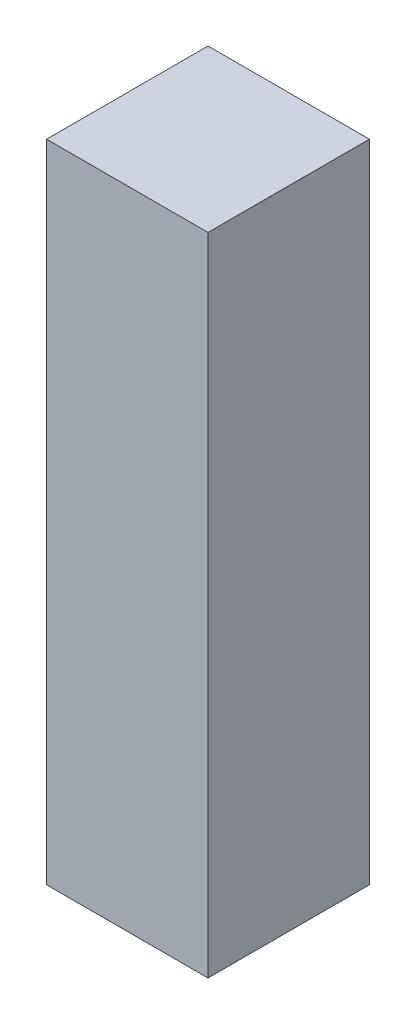
ISO-10303-21;
HEADER;
FILE_DESCRIPTION(('STEP AP214'),'2;1');
FILE_NAME('part.step','',(''),(''),'','','');
FILE_SCHEMA(('AUTOMOTIVE_DESIGN { 1 0 10303 214 1 1 1 1 }'));
ENDSEC;
DATA;
#1=APPLICATION_CONTEXT('core data for automotive mechanical design processes');
#2=APPLICATION_PROTOCOL_DEFINITION('international standard','automotive_design',2000,#1);
#3=PRODUCT_CONTEXT('',#1,'mechanical');
#4=PRODUCT('Part','Part','',(#3));
#5=PRODUCT_RELATED_PRODUCT_CATEGORY('part','',(#4));
#6=PRODUCT_DEFINITION_FORMATION('','',#4);
#7=PRODUCT_DEFINITION_CONTEXT('part definition',#1,'design');
#8=PRODUCT_DEFINITION('design','',#6,#7);
#9=PRODUCT_DEFINITION_SHAPE('','',#8);
#10=(LENGTH_UNIT() NAMED_UNIT(*) SI_UNIT(.MILLI.,.METRE.));
#11=(NAMED_UNIT(*) PLANE_ANGLE_UNIT() SI_UNIT($,.RADIAN.));
#12=(NAMED_UNIT(*) SI_UNIT($,.STERADIAN.) SOLID_ANGLE_UNIT());
#13=UNCERTAINTY_MEASURE_WITH_UNIT(LENGTH_MEASURE(1.E-05),#10,'distance_accuracy_value','');
#14=(GEOMETRIC_REPRESENTATION_CONTEXT(3) GLOBAL_UNCERTAINTY_ASSIGNED_CONTEXT((#13)) GLOBAL_UNIT_ASSIGNED_CONTEXT((#10,
#11,#12)) REPRESENTATION_CONTEXT('',''));
#15=CARTESIAN_POINT('',(0.,0.,0.));
#16=DIRECTION('',(0.,0.,1.));
#17=DIRECTION('',(1.,0.,0.));
#18=AXIS2_PLACEMENT_3D('',#15,#16,#17);
#19=CARTESIAN_POINT('',(9.525,76.2,9.525));
#20=DIRECTION('',(-1.,0.,0.));
#21=DIRECTION('',(0.,0.,1.));
#22=AXIS2_PLACEMENT_3D('',#19,#20,#21);
#23=PLANE('',#22);
#24=DIRECTION('',(0.,0.,-1.));
#25=VECTOR('',#24,1.);
#26=CARTESIAN_POINT('',(9.525,0.,9.525));
#27=LINE('',#26,#25);
#28=CARTESIAN_POINT('',(9.525,0.,9.525));
#29=VERTEX_POINT('',#28);
#30=CARTESIAN_POINT('',(9.525,0.,-9.525));
#31=VERTEX_POINT('',#30);
#32=EDGE_CURVE('E102',#29,#31,#27,.T.);
#33=ORIENTED_EDGE('',*,*,#32,.T.);
#34=DIRECTION('',(0.,-1.,0.));
#35=VECTOR('',#34,1.);
#36=CARTESIAN_POINT('',(9.525,76.2,-9.525));
#37=LINE('',#36,#35);
#38=CARTESIAN_POINT('',(9.525,76.2,-9.525));
#39=VERTEX_POINT('',#38);
#40=EDGE_CURVE('E11',#39,#31,#37,.T.);
#41=ORIENTED_EDGE('',*,*,#40,.F.);
#42=DIRECTION('',(0.,0.,-1.));
#43=VECTOR('',#42,1.);
#44=CARTESIAN_POINT('',(9.525,76.2,9.525));
#45=LINE('',#44,#43);
#46=CARTESIAN_POINT('',(9.525,76.2,9.525));
#47=VERTEX_POINT('',#46);
#48=EDGE_CURVE('E90',#47,#39,#45,.T.);
#49=ORIENTED_EDGE('',*,*,#48,.F.);
#50=DIRECTION('',(0.,-1.,0.));
#51=VECTOR('',#50,1.);
#52=CARTESIAN_POINT('',(9.525,76.2,9.525));
#53=LINE('',#52,#51);
#54=EDGE_CURVE('E98',#47,#29,#53,.T.);
#55=ORIENTED_EDGE('',*,*,#54,.T.);
#56=EDGE_LOOP('',(#33,#41,#49,#55));
#57=FACE_BOUND('',#56,.T.);
#58=ADVANCED_FACE('F39',(#57),#23,.F.);
#59=CARTESIAN_POINT('',(-9.52500000000001,76.2,-9.525));
#60=DIRECTION('',(0.,0.,1.));
#61=DIRECTION('',(1.,0.,0.));
#62=AXIS2_PLACEMENT_3D('',#59,#60,#61);
#63=PLANE('',#62);
#64=DIRECTION('',(-1.,0.,0.));
#65=VECTOR('',#64,1.);
#66=CARTESIAN_POINT('',(-9.52500000000001,0.,-9.525));
#67=LINE('',#66,#65);
#68=CARTESIAN_POINT('',(-9.52500000000001,0.,-9.525));
#69=VERTEX_POINT('',#68);
#70=EDGE_CURVE('E94',#31,#69,#67,.T.);
#71=ORIENTED_EDGE('',*,*,#70,.T.);
#72=DIRECTION('',(0.,-1.,0.));
#73=VECTOR('',#72,1.);
#74=CARTESIAN_POINT('',(-9.52500000000001,76.2,-9.525));
#75=LINE('',#74,#73);
#76=CARTESIAN_POINT('',(-9.52500000000001,76.2,-9.525));
#77=VERTEX_POINT('',#76);
#78=EDGE_CURVE('E47',#77,#69,#75,.T.);
#79=ORIENTED_EDGE('',*,*,#78,.F.);
#80=DIRECTION('',(-1.,0.,0.));
#81=VECTOR('',#80,1.);
#82=CARTESIAN_POINT('',(-9.52500000000001,76.2,-9.525));
#83=LINE('',#82,#81);
#84=EDGE_CURVE('E85',#39,#77,#83,.T.);
#85=ORIENTED_EDGE('',*,*,#84,.F.);
#86=ORIENTED_EDGE('',*,*,#40,.T.);
#87=EDGE_LOOP('',(#71,#79,#85,#86));
#88=FACE_BOUND('',#87,.T.);
#89=ADVANCED_FACE('F93',(#88),#63,.F.);
#90=CARTESIAN_POINT('',(-9.52500000000001,76.2,9.525));
#91=DIRECTION('',(1.,0.,0.));
#92=DIRECTION('',(0.,0.,-1.));
#93=AXIS2_PLACEMENT_3D('',#90,#91,#92);
#94=PLANE('',#93);
#95=DIRECTION('',(0.,0.,1.));
#96=VECTOR('',#95,1.);
#97=CARTESIAN_POINT('',(-9.52500000000001,0.,9.525));
#98=LINE('',#97,#96);
#99=CARTESIAN_POINT('',(-9.52500000000001,0.,9.525));
#100=VERTEX_POINT('',#99);
#101=EDGE_CURVE('E72',#69,#100,#98,.T.);
#102=ORIENTED_EDGE('',*,*,#101,.T.);
#103=DIRECTION('',(0.,-1.,0.));
#104=VECTOR('',#103,1.);
#105=CARTESIAN_POINT('',(-9.52500000000001,76.2,9.525));
#106=LINE('',#105,#104);
#107=CARTESIAN_POINT('',(-9.52500000000001,76.2,9.525));
#108=VERTEX_POINT('',#107);
#109=EDGE_CURVE('E95',#108,#100,#106,.T.);
#110=ORIENTED_EDGE('',*,*,#109,.F.);
#111=DIRECTION('',(0.,0.,1.));
#112=VECTOR('',#111,1.);
#113=CARTESIAN_POINT('',(-9.52500000000001,76.2,9.525));
#114=LINE('',#113,#112);
#115=EDGE_CURVE('E88',#77,#108,#114,.T.);
#116=ORIENTED_EDGE('',*,*,#115,.F.);
#117=ORIENTED_EDGE('',*,*,#78,.T.);
#118=EDGE_LOOP('',(#102,#110,#116,#117));
#119=FACE_BOUND('',#118,.T.);
#120=ADVANCED_FACE('F96',(#119),#94,.F.);
#121=CARTESIAN_POINT('',(-9.52500000000001,76.2,9.525));
#122=DIRECTION('',(0.,0.,-1.));
#123=DIRECTION('',(-1.,0.,0.));
#124=AXIS2_PLACEMENT_3D('',#121,#122,#123);
#125=PLANE('',#124);
#126=DIRECTION('',(1.,0.,0.));
#127=VECTOR('',#126,1.);
#128=CARTESIAN_POINT('',(-9.52500000000001,0.,9.525));
#129=LINE('',#128,#127);
#130=EDGE_CURVE('E78',#100,#29,#129,.T.);
#131=ORIENTED_EDGE('',*,*,#130,.T.);
#132=ORIENTED_EDGE('',*,*,#54,.F.);
#133=DIRECTION('',(1.,0.,0.));
#134=VECTOR('',#133,1.);
#135=CARTESIAN_POINT('',(-9.52500000000001,76.2,9.525));
#136=LINE('',#135,#134);
#137=EDGE_CURVE('E55',#108,#47,#136,.T.);
#138=ORIENTED_EDGE('',*,*,#137,.F.);
#139=ORIENTED_EDGE('',*,*,#109,.T.);
#140=EDGE_LOOP('',(#131,#132,#138,#139));
#141=FACE_BOUND('',#140,.T.);
#142=ADVANCED_FACE('F109',(#141),#125,.F.);
#143=CARTESIAN_POINT('',(0.,76.2,0.));
#144=DIRECTION('',(0.,-1.,0.));
#145=DIRECTION('',(0.,0.,-1.));
#146=AXIS2_PLACEMENT_3D('',#143,#144,#145);
#147=PLANE('',#146);
#148=ORIENTED_EDGE('',*,*,#48,.T.);
#149=ORIENTED_EDGE('',*,*,#84,.T.);
#150=ORIENTED_EDGE('',*,*,#115,.T.);
#151=ORIENTED_EDGE('',*,*,#137,.T.);
#152=EDGE_LOOP('',(#148,#149,#150,#151));
#153=FACE_BOUND('',#152,.T.);
#154=ADVANCED_FACE('F86',(#153),#147,.F.);
#155=CARTESIAN_POINT('',(0.,0.,0.));
#156=DIRECTION('',(0.,-1.,0.));
#157=DIRECTION('',(0.,0.,-1.));
#158=AXIS2_PLACEMENT_3D('',#155,#156,#157);
#159=PLANE('',#158);
#160=ORIENTED_EDGE('',*,*,#32,.F.);
#161=ORIENTED_EDGE('',*,*,#130,.F.);
#162=ORIENTED_EDGE('',*,*,#101,.F.);
#163=ORIENTED_EDGE('',*,*,#70,.F.);
#164=EDGE_LOOP('',(#160,#161,#162,#163));
#165=FACE_BOUND('',#164,.T.);
#166=ADVANCED_FACE('F112',(#165),#159,.T.);
#167=CLOSED_SHELL('',(#58,#89,#120,#142,#154,#166));
#168=MANIFOLD_SOLID_BREP('B2',#167);
#169=ADVANCED_BREP_SHAPE_REPRESENTATION('',(#18,#168),#14);
#170=SHAPE_DEFINITION_REPRESENTATION(#9,#169);
ENDSEC;
END-ISO-10303-21;
